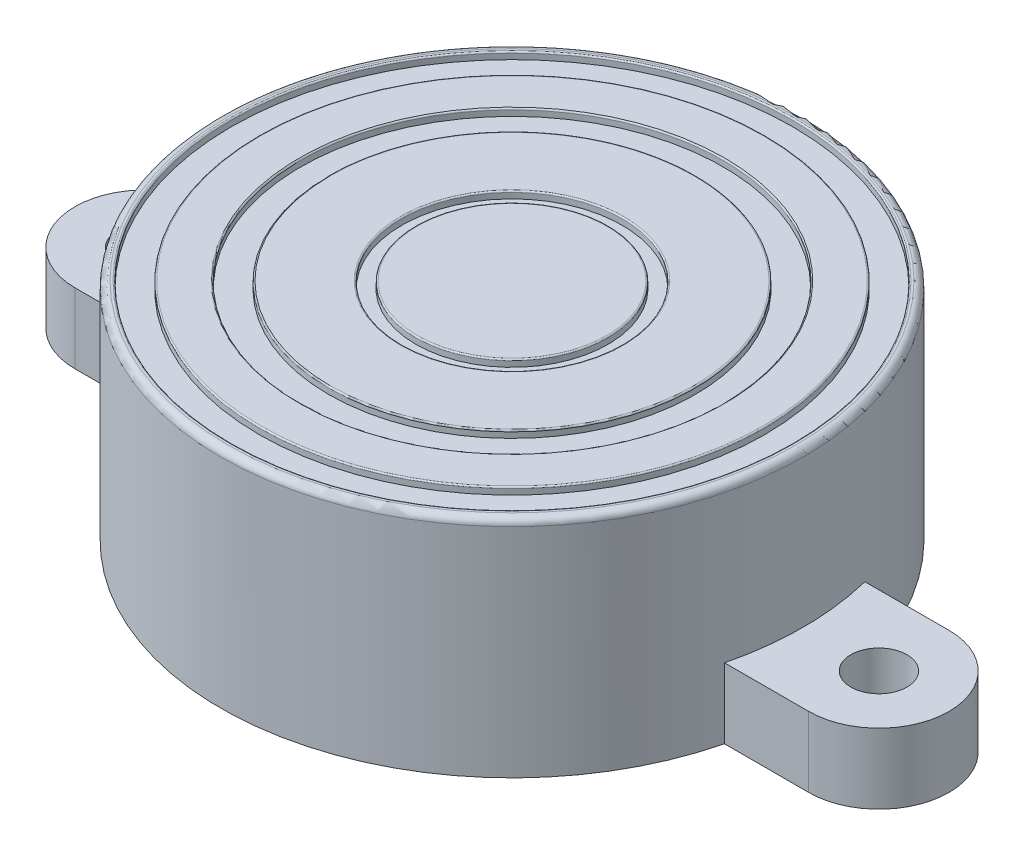
ISO-10303-21;
HEADER;
FILE_DESCRIPTION(('STEP AP214'),'2;1');
FILE_NAME('part.step','',(''),(''),'','','');
FILE_SCHEMA(('AUTOMOTIVE_DESIGN { 1 0 10303 214 1 1 1 1 }'));
ENDSEC;
DATA;
#1=APPLICATION_CONTEXT('core data for automotive mechanical design processes');
#2=APPLICATION_PROTOCOL_DEFINITION('international standard','automotive_design',2000,#1);
#3=PRODUCT_CONTEXT('',#1,'mechanical');
#4=PRODUCT('Part','Part','',(#3));
#5=PRODUCT_RELATED_PRODUCT_CATEGORY('part','',(#4));
#6=PRODUCT_DEFINITION_FORMATION('','',#4);
#7=PRODUCT_DEFINITION_CONTEXT('part definition',#1,'design');
#8=PRODUCT_DEFINITION('design','',#6,#7);
#9=PRODUCT_DEFINITION_SHAPE('','',#8);
#10=(LENGTH_UNIT() NAMED_UNIT(*) SI_UNIT(.MILLI.,.METRE.));
#11=(NAMED_UNIT(*) PLANE_ANGLE_UNIT() SI_UNIT($,.RADIAN.));
#12=(NAMED_UNIT(*) SI_UNIT($,.STERADIAN.) SOLID_ANGLE_UNIT());
#13=UNCERTAINTY_MEASURE_WITH_UNIT(LENGTH_MEASURE(1.E-05),#10,'distance_accuracy_value','');
#14=(GEOMETRIC_REPRESENTATION_CONTEXT(3) GLOBAL_UNCERTAINTY_ASSIGNED_CONTEXT((#13)) GLOBAL_UNIT_ASSIGNED_CONTEXT((#10,
#11,#12)) REPRESENTATION_CONTEXT('',''));
#15=CARTESIAN_POINT('',(0.,0.,0.));
#16=DIRECTION('',(0.,0.,1.));
#17=DIRECTION('',(1.,0.,0.));
#18=AXIS2_PLACEMENT_3D('',#15,#16,#17);
#19=CARTESIAN_POINT('',(0.,16.,0.));
#20=DIRECTION('',(0.,1.,0.));
#21=DIRECTION('',(0.,0.,1.));
#22=AXIS2_PLACEMENT_3D('',#19,#20,#21);
#23=PLANE('',#22);
#24=CARTESIAN_POINT('',(0.,16.,0.));
#25=DIRECTION('',(0.,1.,0.));
#26=DIRECTION('',(0.,0.,1.));
#27=AXIS2_PLACEMENT_3D('',#24,#25,#26);
#28=CIRCLE('',#27,12.95);
#29=CARTESIAN_POINT('',(0.,16.,12.95));
#30=VERTEX_POINT('',#29);
#31=EDGE_CURVE('E226',#30,#30,#28,.T.);
#32=ORIENTED_EDGE('',*,*,#31,.T.);
#33=EDGE_LOOP('',(#32));
#34=FACE_BOUND('',#33,.T.);
#35=CARTESIAN_POINT('',(0.,16.,0.));
#36=DIRECTION('',(0.,1.,0.));
#37=DIRECTION('',(0.,0.,1.));
#38=AXIS2_PLACEMENT_3D('',#35,#36,#37);
#39=CIRCLE('',#38,7.95);
#40=CARTESIAN_POINT('',(0.,16.,7.95));
#41=VERTEX_POINT('',#40);
#42=EDGE_CURVE('E223',#41,#41,#39,.F.);
#43=ORIENTED_EDGE('',*,*,#42,.T.);
#44=EDGE_LOOP('',(#43));
#45=FACE_BOUND('',#44,.T.);
#46=ADVANCED_FACE('F52',(#34,#45),#23,.T.);
#47=CARTESIAN_POINT('',(0.,15.5,0.));
#48=DIRECTION('',(0.,1.,0.));
#49=DIRECTION('',(0.,0.,1.));
#50=AXIS2_PLACEMENT_3D('',#47,#48,#49);
#51=CYLINDRICAL_SURFACE('',#50,6.85);
#52=CARTESIAN_POINT('',(0.,15.9,0.));
#53=DIRECTION('',(0.,1.,0.));
#54=DIRECTION('',(0.,0.,1.));
#55=AXIS2_PLACEMENT_3D('',#52,#53,#54);
#56=CIRCLE('',#55,6.85);
#57=CARTESIAN_POINT('',(0.,15.9,6.85));
#58=VERTEX_POINT('',#57);
#59=EDGE_CURVE('E235',#58,#58,#56,.F.);
#60=ORIENTED_EDGE('',*,*,#59,.T.);
#61=EDGE_LOOP('',(#60));
#62=FACE_BOUND('',#61,.T.);
#63=CARTESIAN_POINT('',(0.,15.5,0.));
#64=DIRECTION('',(0.,1.,0.));
#65=DIRECTION('',(0.,0.,1.));
#66=AXIS2_PLACEMENT_3D('',#63,#64,#65);
#67=CIRCLE('',#66,6.85);
#68=CARTESIAN_POINT('',(0.,15.5,6.85));
#69=VERTEX_POINT('',#68);
#70=EDGE_CURVE('E196',#69,#69,#67,.T.);
#71=ORIENTED_EDGE('',*,*,#70,.T.);
#72=EDGE_LOOP('',(#71));
#73=FACE_BOUND('',#72,.T.);
#74=ADVANCED_FACE('F261',(#62,#73),#51,.T.);
#75=CARTESIAN_POINT('',(0.,15.5,0.));
#76=DIRECTION('',(0.,1.,0.));
#77=DIRECTION('',(0.,0.,1.));
#78=AXIS2_PLACEMENT_3D('',#75,#76,#77);
#79=CYLINDRICAL_SURFACE('',#78,7.85);
#80=CARTESIAN_POINT('',(0.,15.9,0.));
#81=DIRECTION('',(0.,1.,0.));
#82=DIRECTION('',(0.,0.,1.));
#83=AXIS2_PLACEMENT_3D('',#80,#81,#82);
#84=CIRCLE('',#83,7.85);
#85=CARTESIAN_POINT('',(0.,15.9,7.85));
#86=VERTEX_POINT('',#85);
#87=EDGE_CURVE('E238',#86,#86,#84,.T.);
#88=ORIENTED_EDGE('',*,*,#87,.T.);
#89=EDGE_LOOP('',(#88));
#90=FACE_BOUND('',#89,.T.);
#91=CARTESIAN_POINT('',(0.,15.5,0.));
#92=DIRECTION('',(0.,1.,0.));
#93=DIRECTION('',(0.,0.,1.));
#94=AXIS2_PLACEMENT_3D('',#91,#92,#93);
#95=CIRCLE('',#94,7.85);
#96=CARTESIAN_POINT('',(0.,15.5,7.85));
#97=VERTEX_POINT('',#96);
#98=EDGE_CURVE('E199',#97,#97,#95,.T.);
#99=ORIENTED_EDGE('',*,*,#98,.F.);
#100=EDGE_LOOP('',(#99));
#101=FACE_BOUND('',#100,.T.);
#102=ADVANCED_FACE('F269',(#90,#101),#79,.F.);
#103=CARTESIAN_POINT('',(0.,15.5,0.));
#104=DIRECTION('',(0.,1.,0.));
#105=DIRECTION('',(0.,0.,1.));
#106=AXIS2_PLACEMENT_3D('',#103,#104,#105);
#107=PLANE('',#106);
#108=ORIENTED_EDGE('',*,*,#70,.F.);
#109=EDGE_LOOP('',(#108));
#110=FACE_BOUND('',#109,.T.);
#111=ORIENTED_EDGE('',*,*,#98,.T.);
#112=EDGE_LOOP('',(#111));
#113=FACE_BOUND('',#112,.T.);
#114=ADVANCED_FACE('F276',(#110,#113),#107,.T.);
#115=CARTESIAN_POINT('',(0.,16.,0.));
#116=DIRECTION('',(0.,1.,0.));
#117=DIRECTION('',(0.,0.,1.));
#118=AXIS2_PLACEMENT_3D('',#115,#116,#117);
#119=CIRCLE('',#118,6.75);
#120=CARTESIAN_POINT('',(0.,16.,6.75));
#121=VERTEX_POINT('',#120);
#122=EDGE_CURVE('E232',#121,#121,#119,.T.);
#123=ORIENTED_EDGE('',*,*,#122,.T.);
#124=EDGE_LOOP('',(#123));
#125=FACE_BOUND('',#124,.T.);
#126=ADVANCED_FACE('F264',(#125),#23,.T.);
#127=CARTESIAN_POINT('',(0.,15.5,0.));
#128=DIRECTION('',(0.,1.,0.));
#129=DIRECTION('',(0.,0.,1.));
#130=AXIS2_PLACEMENT_3D('',#127,#128,#129);
#131=CYLINDRICAL_SURFACE('',#130,13.05);
#132=CARTESIAN_POINT('',(0.,15.9,0.));
#133=DIRECTION('',(0.,1.,0.));
#134=DIRECTION('',(0.,0.,1.));
#135=AXIS2_PLACEMENT_3D('',#132,#133,#134);
#136=CIRCLE('',#135,13.05);
#137=CARTESIAN_POINT('',(0.,15.9,13.05));
#138=VERTEX_POINT('',#137);
#139=EDGE_CURVE('E229',#138,#138,#136,.F.);
#140=ORIENTED_EDGE('',*,*,#139,.T.);
#141=EDGE_LOOP('',(#140));
#142=FACE_BOUND('',#141,.T.);
#143=CARTESIAN_POINT('',(0.,15.5,0.));
#144=DIRECTION('',(0.,1.,0.));
#145=DIRECTION('',(0.,0.,1.));
#146=AXIS2_PLACEMENT_3D('',#143,#144,#145);
#147=CIRCLE('',#146,13.05);
#148=CARTESIAN_POINT('',(0.,15.5,13.05));
#149=VERTEX_POINT('',#148);
#150=EDGE_CURVE('E190',#149,#149,#147,.T.);
#151=ORIENTED_EDGE('',*,*,#150,.T.);
#152=EDGE_LOOP('',(#151));
#153=FACE_BOUND('',#152,.T.);
#154=ADVANCED_FACE('F275',(#142,#153),#131,.T.);
#155=CARTESIAN_POINT('',(0.,15.5,0.));
#156=DIRECTION('',(0.,1.,0.));
#157=DIRECTION('',(0.,0.,1.));
#158=AXIS2_PLACEMENT_3D('',#155,#156,#157);
#159=CYLINDRICAL_SURFACE('',#158,15.05);
#160=CARTESIAN_POINT('',(0.,15.9,0.));
#161=DIRECTION('',(0.,1.,0.));
#162=DIRECTION('',(0.,0.,1.));
#163=AXIS2_PLACEMENT_3D('',#160,#161,#162);
#164=CIRCLE('',#163,15.05);
#165=CARTESIAN_POINT('',(0.,15.9,15.05));
#166=VERTEX_POINT('',#165);
#167=EDGE_CURVE('E220',#166,#166,#164,.T.);
#168=ORIENTED_EDGE('',*,*,#167,.T.);
#169=EDGE_LOOP('',(#168));
#170=FACE_BOUND('',#169,.T.);
#171=CARTESIAN_POINT('',(0.,15.5,0.));
#172=DIRECTION('',(0.,1.,0.));
#173=DIRECTION('',(0.,0.,1.));
#174=AXIS2_PLACEMENT_3D('',#171,#172,#173);
#175=CIRCLE('',#174,15.05);
#176=CARTESIAN_POINT('',(0.,15.5,15.05));
#177=VERTEX_POINT('',#176);
#178=EDGE_CURVE('E193',#177,#177,#175,.T.);
#179=ORIENTED_EDGE('',*,*,#178,.F.);
#180=EDGE_LOOP('',(#179));
#181=FACE_BOUND('',#180,.T.);
#182=ADVANCED_FACE('F289',(#170,#181),#159,.F.);
#183=CARTESIAN_POINT('',(0.,15.5,0.));
#184=DIRECTION('',(0.,1.,0.));
#185=DIRECTION('',(0.,0.,1.));
#186=AXIS2_PLACEMENT_3D('',#183,#184,#185);
#187=PLANE('',#186);
#188=ORIENTED_EDGE('',*,*,#150,.F.);
#189=EDGE_LOOP('',(#188));
#190=FACE_BOUND('',#189,.T.);
#191=ORIENTED_EDGE('',*,*,#178,.T.);
#192=EDGE_LOOP('',(#191));
#193=FACE_BOUND('',#192,.T.);
#194=ADVANCED_FACE('F280',(#190,#193),#187,.T.);
#195=CARTESIAN_POINT('',(0.,16.,0.));
#196=DIRECTION('',(0.,1.,0.));
#197=DIRECTION('',(0.,0.,1.));
#198=AXIS2_PLACEMENT_3D('',#195,#196,#197);
#199=CIRCLE('',#198,17.9);
#200=CARTESIAN_POINT('',(0.,16.,17.9));
#201=VERTEX_POINT('',#200);
#202=EDGE_CURVE('E214',#201,#201,#199,.T.);
#203=ORIENTED_EDGE('',*,*,#202,.T.);
#204=EDGE_LOOP('',(#203));
#205=FACE_BOUND('',#204,.T.);
#206=CARTESIAN_POINT('',(0.,16.,0.));
#207=DIRECTION('',(0.,1.,0.));
#208=DIRECTION('',(0.,0.,1.));
#209=AXIS2_PLACEMENT_3D('',#206,#207,#208);
#210=CIRCLE('',#209,15.15);
#211=CARTESIAN_POINT('',(0.,16.,15.15));
#212=VERTEX_POINT('',#211);
#213=EDGE_CURVE('E211',#212,#212,#210,.F.);
#214=ORIENTED_EDGE('',*,*,#213,.T.);
#215=EDGE_LOOP('',(#214));
#216=FACE_BOUND('',#215,.T.);
#217=ADVANCED_FACE('F265',(#205,#216),#23,.T.);
#218=CARTESIAN_POINT('',(0.,15.5,0.));
#219=DIRECTION('',(0.,1.,0.));
#220=DIRECTION('',(0.,0.,1.));
#221=AXIS2_PLACEMENT_3D('',#218,#219,#220);
#222=CYLINDRICAL_SURFACE('',#221,18.);
#223=CARTESIAN_POINT('',(0.,15.9,0.));
#224=DIRECTION('',(0.,1.,0.));
#225=DIRECTION('',(0.,0.,1.));
#226=AXIS2_PLACEMENT_3D('',#223,#224,#225);
#227=CIRCLE('',#226,18.);
#228=CARTESIAN_POINT('',(0.,15.9,18.));
#229=VERTEX_POINT('',#228);
#230=EDGE_CURVE('E217',#229,#229,#227,.F.);
#231=ORIENTED_EDGE('',*,*,#230,.T.);
#232=EDGE_LOOP('',(#231));
#233=FACE_BOUND('',#232,.T.);
#234=CARTESIAN_POINT('',(0.,15.5,0.));
#235=DIRECTION('',(0.,1.,0.));
#236=DIRECTION('',(0.,0.,1.));
#237=AXIS2_PLACEMENT_3D('',#234,#235,#236);
#238=CIRCLE('',#237,18.);
#239=CARTESIAN_POINT('',(0.,15.5,18.));
#240=VERTEX_POINT('',#239);
#241=EDGE_CURVE('E178',#240,#240,#238,.T.);
#242=ORIENTED_EDGE('',*,*,#241,.T.);
#243=EDGE_LOOP('',(#242));
#244=FACE_BOUND('',#243,.T.);
#245=ADVANCED_FACE('F279',(#233,#244),#222,.T.);
#246=CARTESIAN_POINT('',(0.,15.5,0.));
#247=DIRECTION('',(0.,1.,0.));
#248=DIRECTION('',(0.,0.,1.));
#249=AXIS2_PLACEMENT_3D('',#246,#247,#248);
#250=CYLINDRICAL_SURFACE('',#249,20.);
#251=CARTESIAN_POINT('',(0.,15.9,0.));
#252=DIRECTION('',(0.,1.,0.));
#253=DIRECTION('',(0.,0.,1.));
#254=AXIS2_PLACEMENT_3D('',#251,#252,#253);
#255=CIRCLE('',#254,20.);
#256=CARTESIAN_POINT('',(0.,15.9,20.));
#257=VERTEX_POINT('',#256);
#258=EDGE_CURVE('E205',#257,#257,#255,.T.);
#259=ORIENTED_EDGE('',*,*,#258,.T.);
#260=EDGE_LOOP('',(#259));
#261=FACE_BOUND('',#260,.T.);
#262=CARTESIAN_POINT('',(0.,15.5,0.));
#263=DIRECTION('',(0.,1.,0.));
#264=DIRECTION('',(0.,0.,1.));
#265=AXIS2_PLACEMENT_3D('',#262,#263,#264);
#266=CIRCLE('',#265,20.);
#267=CARTESIAN_POINT('',(0.,15.5,20.));
#268=VERTEX_POINT('',#267);
#269=EDGE_CURVE('E187',#268,#268,#266,.T.);
#270=ORIENTED_EDGE('',*,*,#269,.F.);
#271=EDGE_LOOP('',(#270));
#272=FACE_BOUND('',#271,.T.);
#273=ADVANCED_FACE('F286',(#261,#272),#250,.F.);
#274=CARTESIAN_POINT('',(0.,15.5,0.));
#275=DIRECTION('',(0.,1.,0.));
#276=DIRECTION('',(0.,0.,1.));
#277=AXIS2_PLACEMENT_3D('',#274,#275,#276);
#278=PLANE('',#277);
#279=ORIENTED_EDGE('',*,*,#241,.F.);
#280=EDGE_LOOP('',(#279));
#281=FACE_BOUND('',#280,.T.);
#282=ORIENTED_EDGE('',*,*,#269,.T.);
#283=EDGE_LOOP('',(#282));
#284=FACE_BOUND('',#283,.T.);
#285=ADVANCED_FACE('F308',(#281,#284),#278,.T.);
#286=CARTESIAN_POINT('',(0.,0.,0.));
#287=DIRECTION('',(0.,1.,0.));
#288=DIRECTION('',(0.,0.,1.));
#289=AXIS2_PLACEMENT_3D('',#286,#287,#288);
#290=PLANE('',#289);
#291=CARTESIAN_POINT('',(-26.1385823731463,0.,0.));
#292=DIRECTION('',(0.,1.,0.));
#293=DIRECTION('',(0.,0.,1.));
#294=AXIS2_PLACEMENT_3D('',#291,#292,#293);
#295=CIRCLE('',#294,2.);
#296=CARTESIAN_POINT('',(-26.1385823731463,0.,2.));
#297=VERTEX_POINT('',#296);
#298=EDGE_CURVE('E390',#297,#297,#295,.F.);
#299=ORIENTED_EDGE('',*,*,#298,.F.);
#300=EDGE_LOOP('',(#299));
#301=FACE_BOUND('',#300,.T.);
#302=CARTESIAN_POINT('',(26.1385823731463,0.,0.));
#303=DIRECTION('',(0.,1.,0.));
#304=DIRECTION('',(0.,0.,1.));
#305=AXIS2_PLACEMENT_3D('',#302,#303,#304);
#306=CIRCLE('',#305,2.);
#307=CARTESIAN_POINT('',(26.1385823731463,0.,2.));
#308=VERTEX_POINT('',#307);
#309=EDGE_CURVE('E143',#308,#308,#306,.F.);
#310=ORIENTED_EDGE('',*,*,#309,.F.);
#311=EDGE_LOOP('',(#310));
#312=FACE_BOUND('',#311,.T.);
#313=CARTESIAN_POINT('',(0.,0.,0.));
#314=DIRECTION('',(0.,1.,0.));
#315=DIRECTION('',(0.,0.,1.));
#316=AXIS2_PLACEMENT_3D('',#313,#314,#315);
#317=CIRCLE('',#316,20.75);
#318=CARTESIAN_POINT('',(-20.1385823731463,0.,5.));
#319=VERTEX_POINT('',#318);
#320=CARTESIAN_POINT('',(20.1385823731463,0.,5.));
#321=VERTEX_POINT('',#320);
#322=EDGE_CURVE('E203',#319,#321,#317,.T.);
#323=ORIENTED_EDGE('',*,*,#322,.F.);
#324=DIRECTION('',(-1.,0.,0.));
#325=VECTOR('',#324,1.);
#326=CARTESIAN_POINT('',(0.,0.,5.00000000000002));
#327=LINE('',#326,#325);
#328=CARTESIAN_POINT('',(-26.1385823731463,0.,4.99999999999999));
#329=VERTEX_POINT('',#328);
#330=EDGE_CURVE('E152',#319,#329,#327,.T.);
#331=ORIENTED_EDGE('',*,*,#330,.T.);
#332=CARTESIAN_POINT('',(-26.1385823731463,0.,0.));
#333=DIRECTION('',(0.,-1.,0.));
#334=DIRECTION('',(0.,0.,-1.));
#335=AXIS2_PLACEMENT_3D('',#332,#333,#334);
#336=CIRCLE('',#335,5.);
#337=CARTESIAN_POINT('',(-26.1385823731463,0.,-5.));
#338=VERTEX_POINT('',#337);
#339=EDGE_CURVE('E170',#329,#338,#336,.T.);
#340=ORIENTED_EDGE('',*,*,#339,.T.);
#341=DIRECTION('',(-1.,0.,0.));
#342=VECTOR('',#341,1.);
#343=CARTESIAN_POINT('',(0.,0.,-4.99999999999999));
#344=LINE('',#343,#342);
#345=CARTESIAN_POINT('',(-20.1385823731463,0.,-5.));
#346=VERTEX_POINT('',#345);
#347=EDGE_CURVE('E159',#346,#338,#344,.T.);
#348=ORIENTED_EDGE('',*,*,#347,.F.);
#349=CARTESIAN_POINT('',(20.1385823731463,0.,-5.));
#350=VERTEX_POINT('',#349);
#351=EDGE_CURVE('E202',#350,#346,#317,.T.);
#352=ORIENTED_EDGE('',*,*,#351,.F.);
#353=DIRECTION('',(1.,0.,0.));
#354=VECTOR('',#353,1.);
#355=CARTESIAN_POINT('',(0.,0.,-5.00000000000005));
#356=LINE('',#355,#354);
#357=CARTESIAN_POINT('',(26.1385823731463,0.,-4.99999999999999));
#358=VERTEX_POINT('',#357);
#359=EDGE_CURVE('E148',#350,#358,#356,.T.);
#360=ORIENTED_EDGE('',*,*,#359,.T.);
#361=CARTESIAN_POINT('',(26.1385823731463,0.,0.));
#362=DIRECTION('',(0.,-1.,0.));
#363=DIRECTION('',(0.,0.,-1.));
#364=AXIS2_PLACEMENT_3D('',#361,#362,#363);
#365=CIRCLE('',#364,5.);
#366=CARTESIAN_POINT('',(26.1385823731463,0.,5.));
#367=VERTEX_POINT('',#366);
#368=EDGE_CURVE('E121',#358,#367,#365,.T.);
#369=ORIENTED_EDGE('',*,*,#368,.T.);
#370=DIRECTION('',(1.,0.,0.));
#371=VECTOR('',#370,1.);
#372=CARTESIAN_POINT('',(0.,0.,5.00000000000001));
#373=LINE('',#372,#371);
#374=EDGE_CURVE('E138',#321,#367,#373,.T.);
#375=ORIENTED_EDGE('',*,*,#374,.F.);
#376=EDGE_LOOP('',(#323,#331,#340,#348,#352,#360,#369,#375));
#377=FACE_BOUND('',#376,.T.);
#378=ADVANCED_FACE('F303',(#301,#312,#377),#290,.F.);
#379=CARTESIAN_POINT('',(0.,16.,0.));
#380=DIRECTION('',(0.,-1.,0.));
#381=DIRECTION('',(0.,0.,-1.));
#382=AXIS2_PLACEMENT_3D('',#379,#380,#381);
#383=CYLINDRICAL_SURFACE('',#382,20.75);
#384=CARTESIAN_POINT('',(0.,5.,0.));
#385=DIRECTION('',(0.,-1.,0.));
#386=DIRECTION('',(0.,0.,-1.));
#387=AXIS2_PLACEMENT_3D('',#384,#385,#386);
#388=CIRCLE('',#387,20.75);
#389=CARTESIAN_POINT('',(20.1385823731463,5.,-5.));
#390=VERTEX_POINT('',#389);
#391=CARTESIAN_POINT('',(20.1385823731463,5.,5.));
#392=VERTEX_POINT('',#391);
#393=EDGE_CURVE('E71',#390,#392,#388,.T.);
#394=ORIENTED_EDGE('',*,*,#393,.F.);
#395=DIRECTION('',(0.,-1.,0.));
#396=VECTOR('',#395,1.);
#397=CARTESIAN_POINT('',(20.1385823731463,5.,-5.));
#398=LINE('',#397,#396);
#399=EDGE_CURVE('E137',#390,#350,#398,.T.);
#400=ORIENTED_EDGE('',*,*,#399,.T.);
#401=ORIENTED_EDGE('',*,*,#351,.T.);
#402=DIRECTION('',(0.,-1.,0.));
#403=VECTOR('',#402,1.);
#404=CARTESIAN_POINT('',(-20.1385823731463,5.,-5.));
#405=LINE('',#404,#403);
#406=CARTESIAN_POINT('',(-20.1385823731463,5.,-5.));
#407=VERTEX_POINT('',#406);
#408=EDGE_CURVE('E179',#407,#346,#405,.T.);
#409=ORIENTED_EDGE('',*,*,#408,.F.);
#410=CARTESIAN_POINT('',(0.,5.,0.));
#411=DIRECTION('',(0.,-1.,0.));
#412=DIRECTION('',(0.,0.,-1.));
#413=AXIS2_PLACEMENT_3D('',#410,#411,#412);
#414=CIRCLE('',#413,20.75);
#415=CARTESIAN_POINT('',(-20.1385823731463,5.,5.));
#416=VERTEX_POINT('',#415);
#417=EDGE_CURVE('E164',#416,#407,#414,.T.);
#418=ORIENTED_EDGE('',*,*,#417,.F.);
#419=DIRECTION('',(0.,-1.,0.));
#420=VECTOR('',#419,1.);
#421=CARTESIAN_POINT('',(-20.1385823731463,5.,5.));
#422=LINE('',#421,#420);
#423=EDGE_CURVE('E175',#416,#319,#422,.T.);
#424=ORIENTED_EDGE('',*,*,#423,.T.);
#425=ORIENTED_EDGE('',*,*,#322,.T.);
#426=DIRECTION('',(0.,-1.,0.));
#427=VECTOR('',#426,1.);
#428=CARTESIAN_POINT('',(20.1385823731463,5.,5.));
#429=LINE('',#428,#427);
#430=EDGE_CURVE('E67',#392,#321,#429,.T.);
#431=ORIENTED_EDGE('',*,*,#430,.F.);
#432=EDGE_LOOP('',(#394,#400,#401,#409,#418,#424,#425,#431));
#433=FACE_BOUND('',#432,.T.);
#434=CARTESIAN_POINT('',(0.,15.5,0.));
#435=DIRECTION('',(0.,1.,0.));
#436=DIRECTION('',(0.,0.,1.));
#437=AXIS2_PLACEMENT_3D('',#434,#435,#436);
#438=CIRCLE('',#437,20.75);
#439=CARTESIAN_POINT('',(0.,15.5,20.75));
#440=VERTEX_POINT('',#439);
#441=EDGE_CURVE('E12',#440,#440,#438,.F.);
#442=ORIENTED_EDGE('',*,*,#441,.T.);
#443=EDGE_LOOP('',(#442));
#444=FACE_BOUND('',#443,.T.);
#445=ADVANCED_FACE('F295',(#433,#444),#383,.T.);
#446=CARTESIAN_POINT('',(0.,16.,0.));
#447=DIRECTION('',(0.,1.,0.));
#448=DIRECTION('',(0.,0.,1.));
#449=AXIS2_PLACEMENT_3D('',#446,#447,#448);
#450=CIRCLE('',#449,20.25);
#451=CARTESIAN_POINT('',(0.,16.,20.25));
#452=VERTEX_POINT('',#451);
#453=EDGE_CURVE('E60',#452,#452,#450,.T.);
#454=ORIENTED_EDGE('',*,*,#453,.T.);
#455=EDGE_LOOP('',(#454));
#456=FACE_BOUND('',#455,.T.);
#457=CARTESIAN_POINT('',(0.,16.,0.));
#458=DIRECTION('',(0.,1.,0.));
#459=DIRECTION('',(0.,0.,1.));
#460=AXIS2_PLACEMENT_3D('',#457,#458,#459);
#461=CIRCLE('',#460,20.1);
#462=CARTESIAN_POINT('',(0.,16.,20.1));
#463=VERTEX_POINT('',#462);
#464=EDGE_CURVE('E208',#463,#463,#461,.F.);
#465=ORIENTED_EDGE('',*,*,#464,.T.);
#466=EDGE_LOOP('',(#465));
#467=FACE_BOUND('',#466,.T.);
#468=ADVANCED_FACE('F243',(#456,#467),#23,.T.);
#469=CARTESIAN_POINT('',(0.,15.9,0.));
#470=DIRECTION('',(0.,1.,0.));
#471=DIRECTION('',(0.,0.,1.));
#472=AXIS2_PLACEMENT_3D('',#469,#470,#471);
#473=TOROIDAL_SURFACE('',#472,20.1,0.1);
#474=ORIENTED_EDGE('',*,*,#464,.F.);
#475=EDGE_LOOP('',(#474));
#476=FACE_BOUND('',#475,.T.);
#477=ORIENTED_EDGE('',*,*,#258,.F.);
#478=EDGE_LOOP('',(#477));
#479=FACE_BOUND('',#478,.T.);
#480=ADVANCED_FACE('F294',(#476,#479),#473,.T.);
#481=CARTESIAN_POINT('',(0.,15.9,0.));
#482=DIRECTION('',(0.,1.,0.));
#483=DIRECTION('',(0.,0.,1.));
#484=AXIS2_PLACEMENT_3D('',#481,#482,#483);
#485=TOROIDAL_SURFACE('',#484,17.9,0.1);
#486=ORIENTED_EDGE('',*,*,#230,.F.);
#487=EDGE_LOOP('',(#486));
#488=FACE_BOUND('',#487,.T.);
#489=ORIENTED_EDGE('',*,*,#202,.F.);
#490=EDGE_LOOP('',(#489));
#491=FACE_BOUND('',#490,.T.);
#492=ADVANCED_FACE('F300',(#488,#491),#485,.T.);
#493=CARTESIAN_POINT('',(0.,15.9,0.));
#494=DIRECTION('',(0.,1.,0.));
#495=DIRECTION('',(0.,0.,1.));
#496=AXIS2_PLACEMENT_3D('',#493,#494,#495);
#497=TOROIDAL_SURFACE('',#496,15.15,0.1);
#498=ORIENTED_EDGE('',*,*,#213,.F.);
#499=EDGE_LOOP('',(#498));
#500=FACE_BOUND('',#499,.T.);
#501=ORIENTED_EDGE('',*,*,#167,.F.);
#502=EDGE_LOOP('',(#501));
#503=FACE_BOUND('',#502,.T.);
#504=ADVANCED_FACE('F314',(#500,#503),#497,.T.);
#505=CARTESIAN_POINT('',(0.,15.9,0.));
#506=DIRECTION('',(0.,1.,0.));
#507=DIRECTION('',(0.,0.,1.));
#508=AXIS2_PLACEMENT_3D('',#505,#506,#507);
#509=TOROIDAL_SURFACE('',#508,12.95,0.1);
#510=ORIENTED_EDGE('',*,*,#139,.F.);
#511=EDGE_LOOP('',(#510));
#512=FACE_BOUND('',#511,.T.);
#513=ORIENTED_EDGE('',*,*,#31,.F.);
#514=EDGE_LOOP('',(#513));
#515=FACE_BOUND('',#514,.T.);
#516=ADVANCED_FACE('F318',(#512,#515),#509,.T.);
#517=CARTESIAN_POINT('',(0.,15.9,0.));
#518=DIRECTION('',(0.,1.,0.));
#519=DIRECTION('',(0.,0.,1.));
#520=AXIS2_PLACEMENT_3D('',#517,#518,#519);
#521=TOROIDAL_SURFACE('',#520,6.75,0.1);
#522=ORIENTED_EDGE('',*,*,#59,.F.);
#523=EDGE_LOOP('',(#522));
#524=FACE_BOUND('',#523,.T.);
#525=ORIENTED_EDGE('',*,*,#122,.F.);
#526=EDGE_LOOP('',(#525));
#527=FACE_BOUND('',#526,.T.);
#528=ADVANCED_FACE('F257',(#524,#527),#521,.T.);
#529=CARTESIAN_POINT('',(0.,15.9,0.));
#530=DIRECTION('',(0.,1.,0.));
#531=DIRECTION('',(0.,0.,1.));
#532=AXIS2_PLACEMENT_3D('',#529,#530,#531);
#533=TOROIDAL_SURFACE('',#532,7.95,0.1);
#534=ORIENTED_EDGE('',*,*,#42,.F.);
#535=EDGE_LOOP('',(#534));
#536=FACE_BOUND('',#535,.T.);
#537=ORIENTED_EDGE('',*,*,#87,.F.);
#538=EDGE_LOOP('',(#537));
#539=FACE_BOUND('',#538,.T.);
#540=ADVANCED_FACE('F248',(#536,#539),#533,.T.);
#541=CARTESIAN_POINT('',(0.,15.5,0.));
#542=DIRECTION('',(0.,1.,0.));
#543=DIRECTION('',(0.,0.,1.));
#544=AXIS2_PLACEMENT_3D('',#541,#542,#543);
#545=TOROIDAL_SURFACE('',#544,20.25,0.5);
#546=ORIENTED_EDGE('',*,*,#441,.F.);
#547=EDGE_LOOP('',(#546));
#548=FACE_BOUND('',#547,.T.);
#549=ORIENTED_EDGE('',*,*,#453,.F.);
#550=EDGE_LOOP('',(#549));
#551=FACE_BOUND('',#550,.T.);
#552=ADVANCED_FACE('F54',(#548,#551),#545,.T.);
#553=CARTESIAN_POINT('',(0.,5.,5.00000000000002));
#554=DIRECTION('',(0.,0.,1.));
#555=DIRECTION('',(1.,0.,0.));
#556=AXIS2_PLACEMENT_3D('',#553,#554,#555);
#557=PLANE('',#556);
#558=ORIENTED_EDGE('',*,*,#330,.F.);
#559=ORIENTED_EDGE('',*,*,#423,.F.);
#560=DIRECTION('',(-1.,0.,0.));
#561=VECTOR('',#560,1.);
#562=CARTESIAN_POINT('',(0.,5.,5.00000000000002));
#563=LINE('',#562,#561);
#564=CARTESIAN_POINT('',(-26.1385823731463,5.,4.99999999999999));
#565=VERTEX_POINT('',#564);
#566=EDGE_CURVE('E155',#416,#565,#563,.T.);
#567=ORIENTED_EDGE('',*,*,#566,.T.);
#568=DIRECTION('',(0.,-1.,0.));
#569=VECTOR('',#568,1.);
#570=CARTESIAN_POINT('',(-26.1385823731463,5.,4.99999999999999));
#571=LINE('',#570,#569);
#572=EDGE_CURVE('E167',#565,#329,#571,.T.);
#573=ORIENTED_EDGE('',*,*,#572,.T.);
#574=EDGE_LOOP('',(#558,#559,#567,#573));
#575=FACE_BOUND('',#574,.T.);
#576=ADVANCED_FACE('F247',(#575),#557,.T.);
#577=CARTESIAN_POINT('',(0.,5.,-4.99999999999999));
#578=DIRECTION('',(0.,0.,1.));
#579=DIRECTION('',(1.,0.,0.));
#580=AXIS2_PLACEMENT_3D('',#577,#578,#579);
#581=PLANE('',#580);
#582=ORIENTED_EDGE('',*,*,#347,.T.);
#583=DIRECTION('',(0.,-1.,0.));
#584=VECTOR('',#583,1.);
#585=CARTESIAN_POINT('',(-26.1385823731463,5.,-5.));
#586=LINE('',#585,#584);
#587=CARTESIAN_POINT('',(-26.1385823731463,5.,-5.));
#588=VERTEX_POINT('',#587);
#589=EDGE_CURVE('E182',#588,#338,#586,.T.);
#590=ORIENTED_EDGE('',*,*,#589,.F.);
#591=DIRECTION('',(-1.,0.,0.));
#592=VECTOR('',#591,1.);
#593=CARTESIAN_POINT('',(0.,5.,-4.99999999999999));
#594=LINE('',#593,#592);
#595=EDGE_CURVE('E162',#407,#588,#594,.T.);
#596=ORIENTED_EDGE('',*,*,#595,.F.);
#597=ORIENTED_EDGE('',*,*,#408,.T.);
#598=EDGE_LOOP('',(#582,#590,#596,#597));
#599=FACE_BOUND('',#598,.T.);
#600=ADVANCED_FACE('F254',(#599),#581,.F.);
#601=CARTESIAN_POINT('',(-26.1385823731463,5.,0.));
#602=DIRECTION('',(0.,-1.,0.));
#603=DIRECTION('',(0.,0.,-1.));
#604=AXIS2_PLACEMENT_3D('',#601,#602,#603);
#605=CYLINDRICAL_SURFACE('',#604,5.);
#606=ORIENTED_EDGE('',*,*,#339,.F.);
#607=ORIENTED_EDGE('',*,*,#572,.F.);
#608=CARTESIAN_POINT('',(-26.1385823731463,5.,0.));
#609=DIRECTION('',(0.,-1.,0.));
#610=DIRECTION('',(0.,0.,-1.));
#611=AXIS2_PLACEMENT_3D('',#608,#609,#610);
#612=CIRCLE('',#611,5.);
#613=EDGE_CURVE('E158',#565,#588,#612,.T.);
#614=ORIENTED_EDGE('',*,*,#613,.T.);
#615=ORIENTED_EDGE('',*,*,#589,.T.);
#616=EDGE_LOOP('',(#606,#607,#614,#615));
#617=FACE_BOUND('',#616,.T.);
#618=ADVANCED_FACE('F356',(#617),#605,.T.);
#619=CARTESIAN_POINT('',(0.,5.,0.));
#620=DIRECTION('',(0.,-1.,0.));
#621=DIRECTION('',(0.,0.,-1.));
#622=AXIS2_PLACEMENT_3D('',#619,#620,#621);
#623=PLANE('',#622);
#624=CARTESIAN_POINT('',(-26.1385823731463,5.,0.));
#625=DIRECTION('',(0.,1.,0.));
#626=DIRECTION('',(0.,0.,1.));
#627=AXIS2_PLACEMENT_3D('',#624,#625,#626);
#628=CIRCLE('',#627,2.);
#629=CARTESIAN_POINT('',(-26.1385823731463,5.,2.));
#630=VERTEX_POINT('',#629);
#631=EDGE_CURVE('E393',#630,#630,#628,.T.);
#632=ORIENTED_EDGE('',*,*,#631,.F.);
#633=EDGE_LOOP('',(#632));
#634=FACE_BOUND('',#633,.T.);
#635=ORIENTED_EDGE('',*,*,#566,.F.);
#636=ORIENTED_EDGE('',*,*,#417,.T.);
#637=ORIENTED_EDGE('',*,*,#595,.T.);
#638=ORIENTED_EDGE('',*,*,#613,.F.);
#639=EDGE_LOOP('',(#635,#636,#637,#638));
#640=FACE_BOUND('',#639,.T.);
#641=ADVANCED_FACE('F359',(#634,#640),#623,.F.);
#642=CARTESIAN_POINT('',(0.,5.,-5.00000000000005));
#643=DIRECTION('',(0.,0.,-1.));
#644=DIRECTION('',(-1.,0.,0.));
#645=AXIS2_PLACEMENT_3D('',#642,#643,#644);
#646=PLANE('',#645);
#647=ORIENTED_EDGE('',*,*,#359,.F.);
#648=ORIENTED_EDGE('',*,*,#399,.F.);
#649=DIRECTION('',(1.,0.,0.));
#650=VECTOR('',#649,1.);
#651=CARTESIAN_POINT('',(0.,5.,-5.00000000000005));
#652=LINE('',#651,#650);
#653=CARTESIAN_POINT('',(26.1385823731463,5.,-4.99999999999999));
#654=VERTEX_POINT('',#653);
#655=EDGE_CURVE('E131',#390,#654,#652,.T.);
#656=ORIENTED_EDGE('',*,*,#655,.T.);
#657=DIRECTION('',(0.,-1.,0.));
#658=VECTOR('',#657,1.);
#659=CARTESIAN_POINT('',(26.1385823731463,5.,-4.99999999999999));
#660=LINE('',#659,#658);
#661=EDGE_CURVE('E116',#654,#358,#660,.T.);
#662=ORIENTED_EDGE('',*,*,#661,.T.);
#663=EDGE_LOOP('',(#647,#648,#656,#662));
#664=FACE_BOUND('',#663,.T.);
#665=ADVANCED_FACE('F136',(#664),#646,.T.);
#666=CARTESIAN_POINT('',(0.,5.,5.00000000000001));
#667=DIRECTION('',(0.,0.,-1.));
#668=DIRECTION('',(-1.,0.,0.));
#669=AXIS2_PLACEMENT_3D('',#666,#667,#668);
#670=PLANE('',#669);
#671=ORIENTED_EDGE('',*,*,#374,.T.);
#672=DIRECTION('',(0.,-1.,0.));
#673=VECTOR('',#672,1.);
#674=CARTESIAN_POINT('',(26.1385823731463,5.,5.));
#675=LINE('',#674,#673);
#676=CARTESIAN_POINT('',(26.1385823731463,5.,5.));
#677=VERTEX_POINT('',#676);
#678=EDGE_CURVE('E126',#677,#367,#675,.T.);
#679=ORIENTED_EDGE('',*,*,#678,.F.);
#680=DIRECTION('',(1.,0.,0.));
#681=VECTOR('',#680,1.);
#682=CARTESIAN_POINT('',(0.,5.,5.00000000000001));
#683=LINE('',#682,#681);
#684=EDGE_CURVE('E133',#392,#677,#683,.T.);
#685=ORIENTED_EDGE('',*,*,#684,.F.);
#686=ORIENTED_EDGE('',*,*,#430,.T.);
#687=EDGE_LOOP('',(#671,#679,#685,#686));
#688=FACE_BOUND('',#687,.T.);
#689=ADVANCED_FACE('F369',(#688),#670,.F.);
#690=CARTESIAN_POINT('',(26.1385823731463,5.,0.));
#691=DIRECTION('',(0.,-1.,0.));
#692=DIRECTION('',(0.,0.,-1.));
#693=AXIS2_PLACEMENT_3D('',#690,#691,#692);
#694=CYLINDRICAL_SURFACE('',#693,5.);
#695=ORIENTED_EDGE('',*,*,#368,.F.);
#696=ORIENTED_EDGE('',*,*,#661,.F.);
#697=CARTESIAN_POINT('',(26.1385823731463,5.,0.));
#698=DIRECTION('',(0.,-1.,0.));
#699=DIRECTION('',(0.,0.,-1.));
#700=AXIS2_PLACEMENT_3D('',#697,#698,#699);
#701=CIRCLE('',#700,5.);
#702=EDGE_CURVE('E119',#654,#677,#701,.T.);
#703=ORIENTED_EDGE('',*,*,#702,.T.);
#704=ORIENTED_EDGE('',*,*,#678,.T.);
#705=EDGE_LOOP('',(#695,#696,#703,#704));
#706=FACE_BOUND('',#705,.T.);
#707=ADVANCED_FACE('F118',(#706),#694,.T.);
#708=CARTESIAN_POINT('',(0.,5.,0.));
#709=DIRECTION('',(0.,-1.,0.));
#710=DIRECTION('',(0.,0.,-1.));
#711=AXIS2_PLACEMENT_3D('',#708,#709,#710);
#712=PLANE('',#711);
#713=CARTESIAN_POINT('',(26.1385823731463,5.,0.));
#714=DIRECTION('',(0.,1.,0.));
#715=DIRECTION('',(0.,0.,1.));
#716=AXIS2_PLACEMENT_3D('',#713,#714,#715);
#717=CIRCLE('',#716,2.);
#718=CARTESIAN_POINT('',(26.1385823731463,5.,2.));
#719=VERTEX_POINT('',#718);
#720=EDGE_CURVE('E395',#719,#719,#717,.T.);
#721=ORIENTED_EDGE('',*,*,#720,.F.);
#722=EDGE_LOOP('',(#721));
#723=FACE_BOUND('',#722,.T.);
#724=ORIENTED_EDGE('',*,*,#655,.F.);
#725=ORIENTED_EDGE('',*,*,#393,.T.);
#726=ORIENTED_EDGE('',*,*,#684,.T.);
#727=ORIENTED_EDGE('',*,*,#702,.F.);
#728=EDGE_LOOP('',(#724,#725,#726,#727));
#729=FACE_BOUND('',#728,.T.);
#730=ADVANCED_FACE('F130',(#723,#729),#712,.F.);
#731=CARTESIAN_POINT('',(26.1385823731463,-5.65685424949238,0.));
#732=DIRECTION('',(0.,1.,0.));
#733=DIRECTION('',(0.,0.,1.));
#734=AXIS2_PLACEMENT_3D('',#731,#732,#733);
#735=CYLINDRICAL_SURFACE('',#734,2.);
#736=ORIENTED_EDGE('',*,*,#309,.T.);
#737=EDGE_LOOP('',(#736));
#738=FACE_BOUND('',#737,.T.);
#739=ORIENTED_EDGE('',*,*,#720,.T.);
#740=EDGE_LOOP('',(#739));
#741=FACE_BOUND('',#740,.T.);
#742=ADVANCED_FACE('F377',(#738,#741),#735,.F.);
#743=CARTESIAN_POINT('',(-26.1385823731463,-5.65685424949238,0.));
#744=DIRECTION('',(0.,1.,0.));
#745=DIRECTION('',(0.,0.,1.));
#746=AXIS2_PLACEMENT_3D('',#743,#744,#745);
#747=CYLINDRICAL_SURFACE('',#746,2.);
#748=ORIENTED_EDGE('',*,*,#298,.T.);
#749=EDGE_LOOP('',(#748));
#750=FACE_BOUND('',#749,.T.);
#751=ORIENTED_EDGE('',*,*,#631,.T.);
#752=EDGE_LOOP('',(#751));
#753=FACE_BOUND('',#752,.T.);
#754=ADVANCED_FACE('F381',(#750,#753),#747,.F.);
#755=CLOSED_SHELL('',(#46,#74,#102,#114,#126,#154,#182,#194,#217,#245,#273,#285,#378,#445,#468,
#480,#492,#504,#516,#528,#540,#552,#576,#600,#618,#641,#665,#689,#707,#730,#742,#754));
#756=MANIFOLD_SOLID_BREP('B2',#755);
#757=ADVANCED_BREP_SHAPE_REPRESENTATION('',(#18,#756),#14);
#758=SHAPE_DEFINITION_REPRESENTATION(#9,#757);
ENDSEC;
END-ISO-10303-21;
